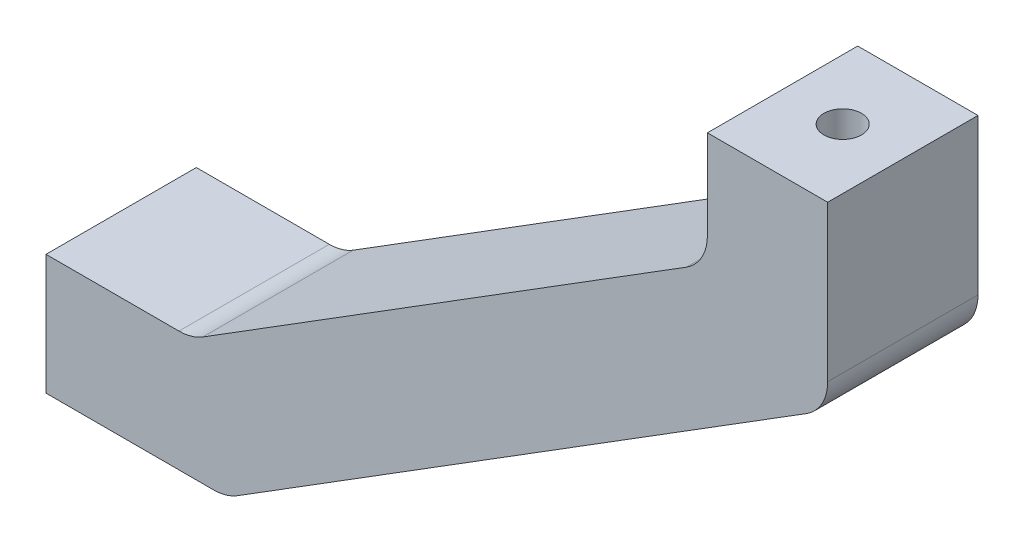
ISO-10303-21;
HEADER;
FILE_DESCRIPTION(('STEP AP214'),'2;1');
FILE_NAME('part.step','',(''),(''),'','','');
FILE_SCHEMA(('AUTOMOTIVE_DESIGN { 1 0 10303 214 1 1 1 1 }'));
ENDSEC;
DATA;
#1=APPLICATION_CONTEXT('core data for automotive mechanical design processes');
#2=APPLICATION_PROTOCOL_DEFINITION('international standard','automotive_design',2000,#1);
#3=PRODUCT_CONTEXT('',#1,'mechanical');
#4=PRODUCT('Part','Part','',(#3));
#5=PRODUCT_RELATED_PRODUCT_CATEGORY('part','',(#4));
#6=PRODUCT_DEFINITION_FORMATION('','',#4);
#7=PRODUCT_DEFINITION_CONTEXT('part definition',#1,'design');
#8=PRODUCT_DEFINITION('design','',#6,#7);
#9=PRODUCT_DEFINITION_SHAPE('','',#8);
#10=(LENGTH_UNIT() NAMED_UNIT(*) SI_UNIT(.MILLI.,.METRE.));
#11=(NAMED_UNIT(*) PLANE_ANGLE_UNIT() SI_UNIT($,.RADIAN.));
#12=(NAMED_UNIT(*) SI_UNIT($,.STERADIAN.) SOLID_ANGLE_UNIT());
#13=UNCERTAINTY_MEASURE_WITH_UNIT(LENGTH_MEASURE(1.E-05),#10,'distance_accuracy_value','');
#14=(GEOMETRIC_REPRESENTATION_CONTEXT(3) GLOBAL_UNCERTAINTY_ASSIGNED_CONTEXT((#13)) GLOBAL_UNIT_ASSIGNED_CONTEXT((#10,
#11,#12)) REPRESENTATION_CONTEXT('',''));
#15=CARTESIAN_POINT('',(0.,0.,0.));
#16=DIRECTION('',(0.,0.,1.));
#17=DIRECTION('',(1.,0.,0.));
#18=AXIS2_PLACEMENT_3D('',#15,#16,#17);
#19=CARTESIAN_POINT('',(38.,14.5,100.));
#20=DIRECTION('',(0.,-1.,0.));
#21=DIRECTION('',(0.,0.,-1.));
#22=AXIS2_PLACEMENT_3D('',#19,#20,#21);
#23=PLANE('',#22);
#24=DIRECTION('',(0.,0.,1.));
#25=VECTOR('',#24,1.);
#26=CARTESIAN_POINT('',(82.,14.5,-97.5));
#27=LINE('',#26,#25);
#28=CARTESIAN_POINT('',(82.,14.5,-22.5));
#29=VERTEX_POINT('',#28);
#30=CARTESIAN_POINT('',(82.,14.5000000000001,-12.5));
#31=VERTEX_POINT('',#30);
#32=EDGE_CURVE('E187',#29,#31,#27,.T.);
#33=ORIENTED_EDGE('',*,*,#32,.T.);
#34=DIRECTION('',(1.,0.,0.));
#35=VECTOR('',#34,1.);
#36=CARTESIAN_POINT('',(-70.9736206611491,14.5000000000001,-12.5));
#37=LINE('',#36,#35);
#38=CARTESIAN_POINT('',(90.,14.5000000000001,-12.5));
#39=VERTEX_POINT('',#38);
#40=EDGE_CURVE('E145',#31,#39,#37,.T.);
#41=ORIENTED_EDGE('',*,*,#40,.T.);
#42=DIRECTION('',(0.,0.,-1.));
#43=VECTOR('',#42,1.);
#44=CARTESIAN_POINT('',(90.,14.5,-97.5));
#45=LINE('',#44,#43);
#46=CARTESIAN_POINT('',(90.,14.5,-22.5));
#47=VERTEX_POINT('',#46);
#48=EDGE_CURVE('E184',#39,#47,#45,.T.);
#49=ORIENTED_EDGE('',*,*,#48,.T.);
#50=DIRECTION('',(1.,0.,0.));
#51=VECTOR('',#50,1.);
#52=CARTESIAN_POINT('',(30.,14.5,-22.5));
#53=LINE('',#52,#51);
#54=EDGE_CURVE('E153',#29,#47,#53,.T.);
#55=ORIENTED_EDGE('',*,*,#54,.F.);
#56=EDGE_LOOP('',(#33,#41,#49,#55));
#57=FACE_BOUND('',#56,.T.);
#58=CARTESIAN_POINT('',(86.,14.5,-17.5));
#59=DIRECTION('',(0.,-1.,0.));
#60=DIRECTION('',(0.,0.,-1.));
#61=AXIS2_PLACEMENT_3D('',#58,#59,#60);
#62=CIRCLE('',#61,1.25);
#63=CARTESIAN_POINT('',(86.,14.5,-18.75));
#64=VERTEX_POINT('',#63);
#65=EDGE_CURVE('E152',#64,#64,#62,.F.);
#66=ORIENTED_EDGE('',*,*,#65,.F.);
#67=EDGE_LOOP('',(#66));
#68=FACE_BOUND('',#67,.T.);
#69=ADVANCED_FACE('F47',(#57,#68),#23,.F.);
#70=CARTESIAN_POINT('',(38.,14.5,100.));
#71=DIRECTION('',(1.,0.,0.));
#72=DIRECTION('',(0.,1.,0.));
#73=AXIS2_PLACEMENT_3D('',#70,#71,#72);
#74=PLANE('',#73);
#75=CARTESIAN_POINT('',(38.,-18.5000000000001,-17.5));
#76=DIRECTION('',(1.,0.,0.));
#77=DIRECTION('',(0.,1.,0.));
#78=AXIS2_PLACEMENT_3D('',#75,#76,#77);
#79=CIRCLE('',#78,1.28393012941216);
#80=CARTESIAN_POINT('',(38.,-17.2160698705879,-17.5));
#81=VERTEX_POINT('',#80);
#82=EDGE_CURVE('E270',#81,#81,#79,.F.);
#83=ORIENTED_EDGE('',*,*,#82,.F.);
#84=EDGE_LOOP('',(#83));
#85=FACE_BOUND('',#84,.T.);
#86=DIRECTION('',(0.,1.,0.));
#87=VECTOR('',#86,1.);
#88=CARTESIAN_POINT('',(38.,-22.5,-22.5));
#89=LINE('',#88,#87);
#90=CARTESIAN_POINT('',(38.,-22.5,-22.5));
#91=VERTEX_POINT('',#90);
#92=CARTESIAN_POINT('',(38.,-14.5,-22.5));
#93=VERTEX_POINT('',#92);
#94=EDGE_CURVE('E148',#91,#93,#89,.T.);
#95=ORIENTED_EDGE('',*,*,#94,.F.);
#96=DIRECTION('',(0.,0.,-1.));
#97=VECTOR('',#96,1.);
#98=CARTESIAN_POINT('',(38.,-22.5,100.));
#99=LINE('',#98,#97);
#100=CARTESIAN_POINT('',(38.,-22.5,-12.5));
#101=VERTEX_POINT('',#100);
#102=EDGE_CURVE('E146',#101,#91,#99,.T.);
#103=ORIENTED_EDGE('',*,*,#102,.F.);
#104=DIRECTION('',(0.,1.,0.));
#105=VECTOR('',#104,1.);
#106=CARTESIAN_POINT('',(38.,14.5000000000001,-12.5));
#107=LINE('',#106,#105);
#108=CARTESIAN_POINT('',(38.,-14.5,-12.5));
#109=VERTEX_POINT('',#108);
#110=EDGE_CURVE('E51',#101,#109,#107,.T.);
#111=ORIENTED_EDGE('',*,*,#110,.T.);
#112=DIRECTION('',(0.,0.,1.));
#113=VECTOR('',#112,1.);
#114=CARTESIAN_POINT('',(38.,-14.5,-97.5));
#115=LINE('',#114,#113);
#116=EDGE_CURVE('E67',#93,#109,#115,.T.);
#117=ORIENTED_EDGE('',*,*,#116,.F.);
#118=EDGE_LOOP('',(#95,#103,#111,#117));
#119=FACE_BOUND('',#118,.T.);
#120=ADVANCED_FACE('F147',(#85,#119),#74,.F.);
#121=CARTESIAN_POINT('',(58.4,-18.5000000000001,-17.5));
#122=DIRECTION('',(1.,0.,0.));
#123=DIRECTION('',(0.,0.,-1.));
#124=AXIS2_PLACEMENT_3D('',#121,#122,#123);
#125=CYLINDRICAL_SURFACE('',#124,3.25);
#126=CARTESIAN_POINT('',(56.3999999999999,-18.5000000000001,-17.5));
#127=DIRECTION('',(0.52999894000318,-0.847998304005088,0.));
#128=DIRECTION('',(0.847998304005088,0.52999894000318,0.));
#129=AXIS2_PLACEMENT_3D('',#126,#127,#128);
#130=ELLIPSE('',#129,6.13208773583679,3.25);
#131=CARTESIAN_POINT('',(61.5999999999999,-15.2500000000001,-17.5));
#132=VERTEX_POINT('',#131);
#133=EDGE_CURVE('E267',#132,#132,#130,.T.);
#134=ORIENTED_EDGE('',*,*,#133,.T.);
#135=EDGE_LOOP('',(#134));
#136=FACE_BOUND('',#135,.T.);
#137=CARTESIAN_POINT('',(50.4,-18.5000000000001,-17.5));
#138=DIRECTION('',(1.,0.,0.));
#139=DIRECTION('',(0.,0.,-1.));
#140=AXIS2_PLACEMENT_3D('',#137,#138,#139);
#141=CIRCLE('',#140,3.25);
#142=CARTESIAN_POINT('',(50.4,-18.5000000000001,-20.75));
#143=VERTEX_POINT('',#142);
#144=EDGE_CURVE('E11',#143,#143,#141,.T.);
#145=ORIENTED_EDGE('',*,*,#144,.F.);
#146=EDGE_LOOP('',(#145));
#147=FACE_BOUND('',#146,.T.);
#148=ADVANCED_FACE('F284',(#136,#147),#125,.F.);
#149=CARTESIAN_POINT('',(47.7056301887095,-14.5,-97.5));
#150=DIRECTION('',(0.,-1.,0.));
#151=DIRECTION('',(1.,0.,0.));
#152=AXIS2_PLACEMENT_3D('',#149,#150,#151);
#153=PLANE('',#152);
#154=DIRECTION('',(1.,0.,0.));
#155=VECTOR('',#154,1.);
#156=CARTESIAN_POINT('',(47.7056301887095,-14.5,-12.5));
#157=LINE('',#156,#155);
#158=CARTESIAN_POINT('',(46.8452415094755,-14.5,-12.5));
#159=VERTEX_POINT('',#158);
#160=EDGE_CURVE('E144',#109,#159,#157,.T.);
#161=ORIENTED_EDGE('',*,*,#160,.T.);
#162=DIRECTION('',(0.,0.,1.));
#163=VECTOR('',#162,1.);
#164=CARTESIAN_POINT('',(46.8452415094755,-14.5,-22.5));
#165=LINE('',#164,#163);
#166=CARTESIAN_POINT('',(46.8452415094755,-14.5,-22.5));
#167=VERTEX_POINT('',#166);
#168=EDGE_CURVE('E226',#159,#167,#165,.F.);
#169=ORIENTED_EDGE('',*,*,#168,.T.);
#170=DIRECTION('',(-1.,0.,0.));
#171=VECTOR('',#170,1.);
#172=CARTESIAN_POINT('',(47.7056301887095,-14.5,-22.5));
#173=LINE('',#172,#171);
#174=EDGE_CURVE('E178',#167,#93,#173,.T.);
#175=ORIENTED_EDGE('',*,*,#174,.T.);
#176=ORIENTED_EDGE('',*,*,#116,.T.);
#177=EDGE_LOOP('',(#161,#169,#175,#176));
#178=FACE_BOUND('',#177,.T.);
#179=ADVANCED_FACE('F290',(#178),#153,.F.);
#180=CARTESIAN_POINT('',(46.8452415094755,-11.5,-97.5));
#181=DIRECTION('',(0.,0.,-1.));
#182=DIRECTION('',(-1.,0.,0.));
#183=AXIS2_PLACEMENT_3D('',#180,#181,#182);
#184=CYLINDRICAL_SURFACE('',#183,3.);
#185=CARTESIAN_POINT('',(46.8452415094755,-11.5,-22.5));
#186=DIRECTION('',(0.,0.,1.));
#187=DIRECTION('',(1.,0.,0.));
#188=AXIS2_PLACEMENT_3D('',#185,#186,#187);
#189=CIRCLE('',#188,3.);
#190=CARTESIAN_POINT('',(48.435238329485,-14.0439949120153,-22.5));
#191=VERTEX_POINT('',#190);
#192=EDGE_CURVE('E263',#167,#191,#189,.T.);
#193=ORIENTED_EDGE('',*,*,#192,.F.);
#194=ORIENTED_EDGE('',*,*,#168,.F.);
#195=CARTESIAN_POINT('',(46.8452415094755,-11.5,-12.5));
#196=DIRECTION('',(0.,0.,-1.));
#197=DIRECTION('',(-1.,0.,0.));
#198=AXIS2_PLACEMENT_3D('',#195,#196,#197);
#199=CIRCLE('',#198,3.);
#200=CARTESIAN_POINT('',(48.435238329485,-14.0439949120153,-12.5));
#201=VERTEX_POINT('',#200);
#202=EDGE_CURVE('E262',#201,#159,#199,.T.);
#203=ORIENTED_EDGE('',*,*,#202,.F.);
#204=DIRECTION('',(0.,0.,1.));
#205=VECTOR('',#204,1.);
#206=CARTESIAN_POINT('',(48.435238329485,-14.0439949120153,-12.5));
#207=LINE('',#206,#205);
#208=EDGE_CURVE('E230',#191,#201,#207,.T.);
#209=ORIENTED_EDGE('',*,*,#208,.F.);
#210=EDGE_LOOP('',(#193,#194,#203,#209));
#211=FACE_BOUND('',#210,.T.);
#212=ADVANCED_FACE('F316',(#211),#184,.F.);
#213=CARTESIAN_POINT('',(82.,6.93398113205661,-97.5));
#214=DIRECTION('',(0.52999894000318,-0.847998304005088,0.));
#215=DIRECTION('',(0.847998304005088,0.52999894000318,0.));
#216=AXIS2_PLACEMENT_3D('',#213,#214,#215);
#217=PLANE('',#216);
#218=DIRECTION('',(0.847998304005088,0.52999894000318,0.));
#219=VECTOR('',#218,1.);
#220=CARTESIAN_POINT('',(82.,6.93398113205661,-12.5));
#221=LINE('',#220,#219);
#222=CARTESIAN_POINT('',(80.5899968200096,6.05272914456257,-12.5));
#223=VERTEX_POINT('',#222);
#224=EDGE_CURVE('E165',#201,#223,#221,.T.);
#225=ORIENTED_EDGE('',*,*,#224,.T.);
#226=DIRECTION('',(0.,0.,1.));
#227=VECTOR('',#226,1.);
#228=CARTESIAN_POINT('',(80.5899968200096,6.05272914456257,-22.5));
#229=LINE('',#228,#227);
#230=CARTESIAN_POINT('',(80.5899968200096,6.05272914456257,-22.5));
#231=VERTEX_POINT('',#230);
#232=EDGE_CURVE('E228',#223,#231,#229,.F.);
#233=ORIENTED_EDGE('',*,*,#232,.T.);
#234=DIRECTION('',(-0.847998304005088,-0.52999894000318,0.));
#235=VECTOR('',#234,1.);
#236=CARTESIAN_POINT('',(82.,6.93398113205661,-22.5));
#237=LINE('',#236,#235);
#238=EDGE_CURVE('E239',#231,#191,#237,.T.);
#239=ORIENTED_EDGE('',*,*,#238,.T.);
#240=ORIENTED_EDGE('',*,*,#208,.T.);
#241=EDGE_LOOP('',(#225,#233,#239,#240));
#242=FACE_BOUND('',#241,.T.);
#243=ADVANCED_FACE('F253',(#242),#217,.F.);
#244=CARTESIAN_POINT('',(79.,8.59672405657783,-97.5));
#245=DIRECTION('',(0.,0.,-1.));
#246=DIRECTION('',(-1.,0.,0.));
#247=AXIS2_PLACEMENT_3D('',#244,#245,#246);
#248=CYLINDRICAL_SURFACE('',#247,3.);
#249=CARTESIAN_POINT('',(79.,8.59672405657783,-22.5));
#250=DIRECTION('',(0.,0.,1.));
#251=DIRECTION('',(1.,0.,0.));
#252=AXIS2_PLACEMENT_3D('',#249,#250,#251);
#253=CIRCLE('',#252,3.);
#254=CARTESIAN_POINT('',(82.,8.59672405657783,-22.5));
#255=VERTEX_POINT('',#254);
#256=EDGE_CURVE('E213',#231,#255,#253,.T.);
#257=ORIENTED_EDGE('',*,*,#256,.F.);
#258=ORIENTED_EDGE('',*,*,#232,.F.);
#259=CARTESIAN_POINT('',(79.,8.59672405657783,-12.5));
#260=DIRECTION('',(0.,0.,-1.));
#261=DIRECTION('',(-1.,0.,0.));
#262=AXIS2_PLACEMENT_3D('',#259,#260,#261);
#263=CIRCLE('',#262,3.);
#264=CARTESIAN_POINT('',(82.,8.59672405657783,-12.5));
#265=VERTEX_POINT('',#264);
#266=EDGE_CURVE('E210',#265,#223,#263,.T.);
#267=ORIENTED_EDGE('',*,*,#266,.F.);
#268=DIRECTION('',(0.,0.,1.));
#269=VECTOR('',#268,1.);
#270=CARTESIAN_POINT('',(82.,8.59672405657783,-12.5));
#271=LINE('',#270,#269);
#272=EDGE_CURVE('E233',#255,#265,#271,.T.);
#273=ORIENTED_EDGE('',*,*,#272,.F.);
#274=EDGE_LOOP('',(#257,#258,#267,#273));
#275=FACE_BOUND('',#274,.T.);
#276=ADVANCED_FACE('F258',(#275),#248,.F.);
#277=CARTESIAN_POINT('',(82.,14.5,-97.5));
#278=DIRECTION('',(1.,0.,0.));
#279=DIRECTION('',(0.,0.,-1.));
#280=AXIS2_PLACEMENT_3D('',#277,#278,#279);
#281=PLANE('',#280);
#282=DIRECTION('',(0.,-1.,0.));
#283=VECTOR('',#282,1.);
#284=CARTESIAN_POINT('',(82.,14.5,-22.5));
#285=LINE('',#284,#283);
#286=EDGE_CURVE('E182',#29,#255,#285,.T.);
#287=ORIENTED_EDGE('',*,*,#286,.T.);
#288=ORIENTED_EDGE('',*,*,#272,.T.);
#289=DIRECTION('',(0.,1.,0.));
#290=VECTOR('',#289,1.);
#291=CARTESIAN_POINT('',(82.,14.5,-12.5));
#292=LINE('',#291,#290);
#293=EDGE_CURVE('E159',#265,#31,#292,.T.);
#294=ORIENTED_EDGE('',*,*,#293,.T.);
#295=ORIENTED_EDGE('',*,*,#32,.F.);
#296=EDGE_LOOP('',(#287,#288,#294,#295));
#297=FACE_BOUND('',#296,.T.);
#298=ADVANCED_FACE('F312',(#297),#281,.F.);
#299=CARTESIAN_POINT('',(90.,2.5,-97.5));
#300=DIRECTION('',(0.52999894000318,-0.847998304005088,0.));
#301=DIRECTION('',(0.847998304005088,0.52999894000318,0.));
#302=AXIS2_PLACEMENT_3D('',#299,#300,#301);
#303=PLANE('',#302);
#304=DIRECTION('',(0.847998304005088,0.52999894000318,0.));
#305=VECTOR('',#304,1.);
#306=CARTESIAN_POINT('',(90.,2.5,-12.5));
#307=LINE('',#306,#305);
#308=CARTESIAN_POINT('',(50.7296081407756,-22.0439949120153,-12.5));
#309=VERTEX_POINT('',#308);
#310=CARTESIAN_POINT('',(88.5899968200095,1.61874801250596,-12.5));
#311=VERTEX_POINT('',#310);
#312=EDGE_CURVE('E177',#309,#311,#307,.T.);
#313=ORIENTED_EDGE('',*,*,#312,.F.);
#314=DIRECTION('',(0.,0.,1.));
#315=VECTOR('',#314,1.);
#316=CARTESIAN_POINT('',(50.7296081407756,-22.0439949120153,-22.5));
#317=LINE('',#316,#315);
#318=CARTESIAN_POINT('',(50.7296081407756,-22.0439949120153,-22.5));
#319=VERTEX_POINT('',#318);
#320=EDGE_CURVE('E218',#309,#319,#317,.F.);
#321=ORIENTED_EDGE('',*,*,#320,.T.);
#322=DIRECTION('',(-0.847998304005088,-0.52999894000318,0.));
#323=VECTOR('',#322,1.);
#324=CARTESIAN_POINT('',(90.,2.5,-22.5));
#325=LINE('',#324,#323);
#326=CARTESIAN_POINT('',(88.5899968200095,1.61874801250596,-22.5));
#327=VERTEX_POINT('',#326);
#328=EDGE_CURVE('E181',#327,#319,#325,.T.);
#329=ORIENTED_EDGE('',*,*,#328,.F.);
#330=DIRECTION('',(0.,0.,1.));
#331=VECTOR('',#330,1.);
#332=CARTESIAN_POINT('',(88.5899968200095,1.61874801250596,-97.5));
#333=LINE('',#332,#331);
#334=EDGE_CURVE('E220',#327,#311,#333,.T.);
#335=ORIENTED_EDGE('',*,*,#334,.T.);
#336=EDGE_LOOP('',(#313,#321,#329,#335));
#337=FACE_BOUND('',#336,.T.);
#338=ORIENTED_EDGE('',*,*,#133,.F.);
#339=EDGE_LOOP('',(#338));
#340=FACE_BOUND('',#339,.T.);
#341=ADVANCED_FACE('F309',(#337,#340),#303,.T.);
#342=CARTESIAN_POINT('',(-70.9736206611491,14.5000000000001,-12.5));
#343=DIRECTION('',(0.,0.,-1.));
#344=DIRECTION('',(-1.,0.,0.));
#345=AXIS2_PLACEMENT_3D('',#342,#343,#344);
#346=PLANE('',#345);
#347=DIRECTION('',(1.,0.,0.));
#348=VECTOR('',#347,1.);
#349=CARTESIAN_POINT('',(-70.9736206611491,-22.5,-12.5));
#350=LINE('',#349,#348);
#351=CARTESIAN_POINT('',(49.139611320766,-22.5,-12.5));
#352=VERTEX_POINT('',#351);
#353=EDGE_CURVE('E142',#101,#352,#350,.T.);
#354=ORIENTED_EDGE('',*,*,#353,.T.);
#355=CARTESIAN_POINT('',(49.139611320766,-19.5,-12.5));
#356=DIRECTION('',(0.,0.,-1.));
#357=DIRECTION('',(-1.,0.,0.));
#358=AXIS2_PLACEMENT_3D('',#355,#356,#357);
#359=CIRCLE('',#358,3.);
#360=EDGE_CURVE('E222',#352,#309,#359,.F.);
#361=ORIENTED_EDGE('',*,*,#360,.T.);
#362=ORIENTED_EDGE('',*,*,#312,.T.);
#363=CARTESIAN_POINT('',(87.,4.16274292452122,-12.5));
#364=DIRECTION('',(0.,0.,-1.));
#365=DIRECTION('',(-1.,0.,0.));
#366=AXIS2_PLACEMENT_3D('',#363,#364,#365);
#367=CIRCLE('',#366,3.);
#368=CARTESIAN_POINT('',(90.,4.16274292452122,-12.5));
#369=VERTEX_POINT('',#368);
#370=EDGE_CURVE('E197',#311,#369,#367,.F.);
#371=ORIENTED_EDGE('',*,*,#370,.T.);
#372=DIRECTION('',(0.,1.,0.));
#373=VECTOR('',#372,1.);
#374=CARTESIAN_POINT('',(90.,14.5000000000001,-12.5));
#375=LINE('',#374,#373);
#376=EDGE_CURVE('E158',#369,#39,#375,.T.);
#377=ORIENTED_EDGE('',*,*,#376,.T.);
#378=ORIENTED_EDGE('',*,*,#40,.F.);
#379=ORIENTED_EDGE('',*,*,#293,.F.);
#380=ORIENTED_EDGE('',*,*,#266,.T.);
#381=ORIENTED_EDGE('',*,*,#224,.F.);
#382=ORIENTED_EDGE('',*,*,#202,.T.);
#383=ORIENTED_EDGE('',*,*,#160,.F.);
#384=ORIENTED_EDGE('',*,*,#110,.F.);
#385=EDGE_LOOP('',(#354,#361,#362,#371,#377,#378,#379,#380,#381,#382,#383,#384));
#386=FACE_BOUND('',#385,.T.);
#387=ADVANCED_FACE('F140',(#386),#346,.F.);
#388=CARTESIAN_POINT('',(30.,-22.5,-22.5));
#389=DIRECTION('',(0.,0.,1.));
#390=DIRECTION('',(1.,0.,0.));
#391=AXIS2_PLACEMENT_3D('',#388,#389,#390);
#392=PLANE('',#391);
#393=DIRECTION('',(-1.,0.,0.));
#394=VECTOR('',#393,1.);
#395=CARTESIAN_POINT('',(30.,-22.5,-22.5));
#396=LINE('',#395,#394);
#397=CARTESIAN_POINT('',(49.139611320766,-22.5,-22.5));
#398=VERTEX_POINT('',#397);
#399=EDGE_CURVE('E236',#398,#91,#396,.T.);
#400=ORIENTED_EDGE('',*,*,#399,.T.);
#401=ORIENTED_EDGE('',*,*,#94,.T.);
#402=ORIENTED_EDGE('',*,*,#174,.F.);
#403=ORIENTED_EDGE('',*,*,#192,.T.);
#404=ORIENTED_EDGE('',*,*,#238,.F.);
#405=ORIENTED_EDGE('',*,*,#256,.T.);
#406=ORIENTED_EDGE('',*,*,#286,.F.);
#407=ORIENTED_EDGE('',*,*,#54,.T.);
#408=DIRECTION('',(0.,-1.,0.));
#409=VECTOR('',#408,1.);
#410=CARTESIAN_POINT('',(90.,22.5,-22.5));
#411=LINE('',#410,#409);
#412=CARTESIAN_POINT('',(90.,4.16274292452122,-22.5));
#413=VERTEX_POINT('',#412);
#414=EDGE_CURVE('E179',#47,#413,#411,.T.);
#415=ORIENTED_EDGE('',*,*,#414,.T.);
#416=CARTESIAN_POINT('',(87.,4.16274292452122,-22.5));
#417=DIRECTION('',(0.,0.,1.));
#418=DIRECTION('',(1.,0.,0.));
#419=AXIS2_PLACEMENT_3D('',#416,#417,#418);
#420=CIRCLE('',#419,3.);
#421=EDGE_CURVE('E208',#413,#327,#420,.F.);
#422=ORIENTED_EDGE('',*,*,#421,.T.);
#423=ORIENTED_EDGE('',*,*,#328,.T.);
#424=CARTESIAN_POINT('',(49.139611320766,-19.5,-22.5));
#425=DIRECTION('',(0.,0.,1.));
#426=DIRECTION('',(1.,0.,0.));
#427=AXIS2_PLACEMENT_3D('',#424,#425,#426);
#428=CIRCLE('',#427,3.);
#429=EDGE_CURVE('E209',#319,#398,#428,.F.);
#430=ORIENTED_EDGE('',*,*,#429,.T.);
#431=EDGE_LOOP('',(#400,#401,#402,#403,#404,#405,#406,#407,#415,#422,#423,#430));
#432=FACE_BOUND('',#431,.T.);
#433=ADVANCED_FACE('F325',(#432),#392,.F.);
#434=CARTESIAN_POINT('',(87.,4.16274292452122,-97.5));
#435=DIRECTION('',(0.,0.,1.));
#436=DIRECTION('',(1.,0.,0.));
#437=AXIS2_PLACEMENT_3D('',#434,#435,#436);
#438=CYLINDRICAL_SURFACE('',#437,3.);
#439=ORIENTED_EDGE('',*,*,#421,.F.);
#440=DIRECTION('',(0.,0.,1.));
#441=VECTOR('',#440,1.);
#442=CARTESIAN_POINT('',(90.,4.16274292452122,-97.5));
#443=LINE('',#442,#441);
#444=EDGE_CURVE('E202',#369,#413,#443,.F.);
#445=ORIENTED_EDGE('',*,*,#444,.F.);
#446=ORIENTED_EDGE('',*,*,#370,.F.);
#447=ORIENTED_EDGE('',*,*,#334,.F.);
#448=EDGE_LOOP('',(#439,#445,#446,#447));
#449=FACE_BOUND('',#448,.T.);
#450=ADVANCED_FACE('F205',(#449),#438,.T.);
#451=CARTESIAN_POINT('',(49.139611320766,-19.5,22.5));
#452=DIRECTION('',(0.,0.,-1.));
#453=DIRECTION('',(-1.,0.,0.));
#454=AXIS2_PLACEMENT_3D('',#451,#452,#453);
#455=CYLINDRICAL_SURFACE('',#454,3.);
#456=ORIENTED_EDGE('',*,*,#429,.F.);
#457=ORIENTED_EDGE('',*,*,#320,.F.);
#458=ORIENTED_EDGE('',*,*,#360,.F.);
#459=DIRECTION('',(0.,0.,1.));
#460=VECTOR('',#459,1.);
#461=CARTESIAN_POINT('',(49.139611320766,-22.5,-12.5));
#462=LINE('',#461,#460);
#463=EDGE_CURVE('E157',#398,#352,#462,.T.);
#464=ORIENTED_EDGE('',*,*,#463,.F.);
#465=EDGE_LOOP('',(#456,#457,#458,#464));
#466=FACE_BOUND('',#465,.T.);
#467=ADVANCED_FACE('F332',(#466),#455,.T.);
#468=CARTESIAN_POINT('',(50.4,-16.8000000000001,-17.5));
#469=DIRECTION('',(-1.,0.,0.));
#470=DIRECTION('',(0.,0.,1.));
#471=AXIS2_PLACEMENT_3D('',#468,#469,#470);
#472=PLANE('',#471);
#473=CARTESIAN_POINT('',(50.4,-18.5000000000001,-17.5));
#474=DIRECTION('',(1.,0.,0.));
#475=DIRECTION('',(0.,0.,-1.));
#476=AXIS2_PLACEMENT_3D('',#473,#474,#475);
#477=CIRCLE('',#476,1.7);
#478=CARTESIAN_POINT('',(50.4,-18.5000000000001,-19.2));
#479=VERTEX_POINT('',#478);
#480=EDGE_CURVE('E56',#479,#479,#477,.T.);
#481=ORIENTED_EDGE('',*,*,#480,.F.);
#482=EDGE_LOOP('',(#481));
#483=FACE_BOUND('',#482,.T.);
#484=ORIENTED_EDGE('',*,*,#144,.T.);
#485=EDGE_LOOP('',(#484));
#486=FACE_BOUND('',#485,.T.);
#487=ADVANCED_FACE('F353',(#483,#486),#472,.F.);
#488=CARTESIAN_POINT('',(58.4,-18.5000000000001,-17.5));
#489=DIRECTION('',(1.,0.,0.));
#490=DIRECTION('',(0.,0.,-1.));
#491=AXIS2_PLACEMENT_3D('',#488,#489,#490);
#492=CYLINDRICAL_SURFACE('',#491,1.69999999999999);
#493=CARTESIAN_POINT('',(38.2500000000001,-18.5000000000001,-17.5));
#494=DIRECTION('',(1.,0.,0.));
#495=DIRECTION('',(0.,0.,-1.));
#496=AXIS2_PLACEMENT_3D('',#493,#494,#495);
#497=CIRCLE('',#496,1.69999999999999);
#498=CARTESIAN_POINT('',(38.2500000000001,-18.5000000000001,-19.2));
#499=VERTEX_POINT('',#498);
#500=EDGE_CURVE('E171',#499,#499,#497,.T.);
#501=ORIENTED_EDGE('',*,*,#500,.F.);
#502=EDGE_LOOP('',(#501));
#503=FACE_BOUND('',#502,.T.);
#504=ORIENTED_EDGE('',*,*,#480,.T.);
#505=EDGE_LOOP('',(#504));
#506=FACE_BOUND('',#505,.T.);
#507=ADVANCED_FACE('F306',(#503,#506),#492,.F.);
#508=CARTESIAN_POINT('',(38.2500000000001,-18.5000000000001,-17.5));
#509=DIRECTION('',(1.,0.,0.));
#510=DIRECTION('',(0.,0.,-1.));
#511=AXIS2_PLACEMENT_3D('',#508,#509,#510);
#512=CONICAL_SURFACE('',#511,1.69999999999999,1.02974425867665);
#513=ORIENTED_EDGE('',*,*,#82,.T.);
#514=EDGE_LOOP('',(#513));
#515=FACE_BOUND('',#514,.T.);
#516=ORIENTED_EDGE('',*,*,#500,.T.);
#517=EDGE_LOOP('',(#516));
#518=FACE_BOUND('',#517,.T.);
#519=ADVANCED_FACE('F280',(#515,#518),#512,.F.);
#520=CARTESIAN_POINT('',(90.,22.5,-97.5));
#521=DIRECTION('',(1.,0.,0.));
#522=DIRECTION('',(0.,0.,-1.));
#523=AXIS2_PLACEMENT_3D('',#520,#521,#522);
#524=PLANE('',#523);
#525=ORIENTED_EDGE('',*,*,#48,.F.);
#526=ORIENTED_EDGE('',*,*,#376,.F.);
#527=ORIENTED_EDGE('',*,*,#444,.T.);
#528=ORIENTED_EDGE('',*,*,#414,.F.);
#529=EDGE_LOOP('',(#525,#526,#527,#528));
#530=FACE_BOUND('',#529,.T.);
#531=ADVANCED_FACE('F201',(#530),#524,.T.);
#532=CARTESIAN_POINT('',(30.,-22.5,22.5));
#533=DIRECTION('',(0.,1.,0.));
#534=DIRECTION('',(0.,0.,1.));
#535=AXIS2_PLACEMENT_3D('',#532,#533,#534);
#536=PLANE('',#535);
#537=ORIENTED_EDGE('',*,*,#353,.F.);
#538=ORIENTED_EDGE('',*,*,#102,.T.);
#539=ORIENTED_EDGE('',*,*,#399,.F.);
#540=ORIENTED_EDGE('',*,*,#463,.T.);
#541=EDGE_LOOP('',(#537,#538,#539,#540));
#542=FACE_BOUND('',#541,.T.);
#543=ADVANCED_FACE('F49',(#542),#536,.F.);
#544=CARTESIAN_POINT('',(86.,5.5,-17.5));
#545=DIRECTION('',(0.,1.,0.));
#546=DIRECTION('',(0.,0.,1.));
#547=AXIS2_PLACEMENT_3D('',#544,#545,#546);
#548=CONICAL_SURFACE('',#547,1.25,1.02974425867666);
#549=CARTESIAN_POINT('',(86.,4.74892422621555,-17.5));
#550=VERTEX_POINT('',#549);
#551=VERTEX_LOOP('',#550);
#552=FACE_BOUND('',#551,.T.);
#553=CARTESIAN_POINT('',(86.,5.5,-17.5));
#554=DIRECTION('',(0.,1.,0.));
#555=DIRECTION('',(0.,0.,1.));
#556=AXIS2_PLACEMENT_3D('',#553,#554,#555);
#557=CIRCLE('',#556,1.25);
#558=CARTESIAN_POINT('',(86.,5.5,-16.25));
#559=VERTEX_POINT('',#558);
#560=EDGE_CURVE('E162',#559,#559,#557,.T.);
#561=ORIENTED_EDGE('',*,*,#560,.T.);
#562=EDGE_LOOP('',(#561));
#563=FACE_BOUND('',#562,.T.);
#564=ADVANCED_FACE('F297',(#552,#563),#548,.F.);
#565=CARTESIAN_POINT('',(86.,22.5,-17.5));
#566=DIRECTION('',(0.,1.,0.));
#567=DIRECTION('',(0.,0.,1.));
#568=AXIS2_PLACEMENT_3D('',#565,#566,#567);
#569=CYLINDRICAL_SURFACE('',#568,1.25);
#570=ORIENTED_EDGE('',*,*,#65,.T.);
#571=EDGE_LOOP('',(#570));
#572=FACE_BOUND('',#571,.T.);
#573=ORIENTED_EDGE('',*,*,#560,.F.);
#574=EDGE_LOOP('',(#573));
#575=FACE_BOUND('',#574,.T.);
#576=ADVANCED_FACE('F293',(#572,#575),#569,.F.);
#577=CLOSED_SHELL('',(#69,#120,#148,#179,#212,#243,#276,#298,#341,#387,#433,#450,#467,#487,#507,
#519,#531,#543,#564,#576));
#578=MANIFOLD_SOLID_BREP('B2',#577);
#579=ADVANCED_BREP_SHAPE_REPRESENTATION('',(#18,#578),#14);
#580=SHAPE_DEFINITION_REPRESENTATION(#9,#579);
ENDSEC;
END-ISO-10303-21;
